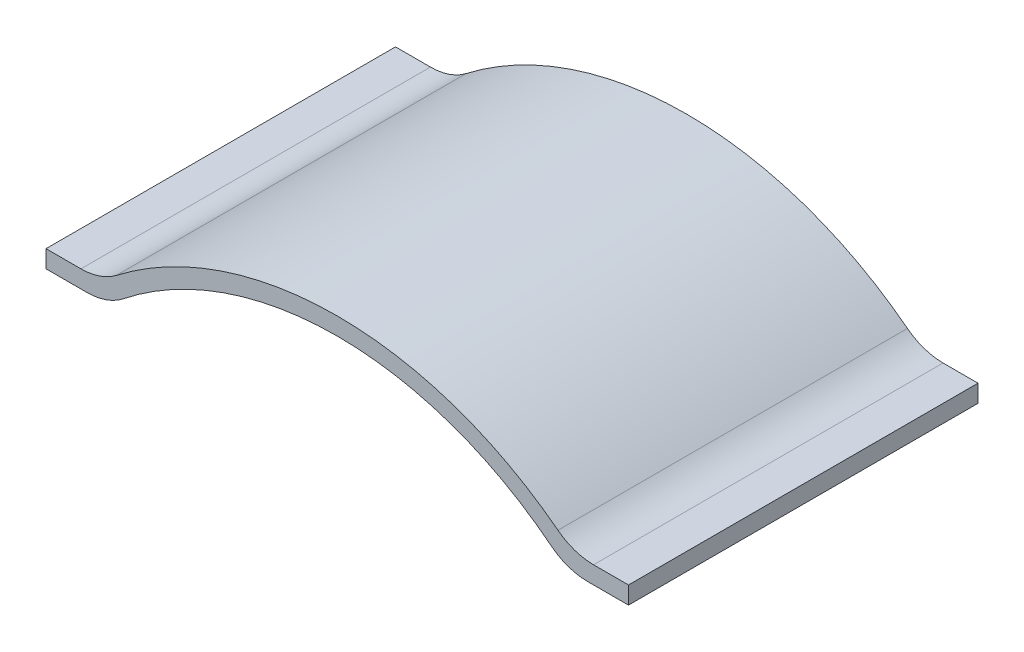
ISO-10303-21;
HEADER;
FILE_DESCRIPTION(('STEP AP214'),'2;1');
FILE_NAME('part.step','',(''),(''),'','','');
FILE_SCHEMA(('AUTOMOTIVE_DESIGN { 1 0 10303 214 1 1 1 1 }'));
ENDSEC;
DATA;
#1=APPLICATION_CONTEXT('core data for automotive mechanical design processes');
#2=APPLICATION_PROTOCOL_DEFINITION('international standard','automotive_design',2000,#1);
#3=PRODUCT_CONTEXT('',#1,'mechanical');
#4=PRODUCT('Part','Part','',(#3));
#5=PRODUCT_RELATED_PRODUCT_CATEGORY('part','',(#4));
#6=PRODUCT_DEFINITION_FORMATION('','',#4);
#7=PRODUCT_DEFINITION_CONTEXT('part definition',#1,'design');
#8=PRODUCT_DEFINITION('design','',#6,#7);
#9=PRODUCT_DEFINITION_SHAPE('','',#8);
#10=(LENGTH_UNIT() NAMED_UNIT(*) SI_UNIT(.MILLI.,.METRE.));
#11=(NAMED_UNIT(*) PLANE_ANGLE_UNIT() SI_UNIT($,.RADIAN.));
#12=(NAMED_UNIT(*) SI_UNIT($,.STERADIAN.) SOLID_ANGLE_UNIT());
#13=UNCERTAINTY_MEASURE_WITH_UNIT(LENGTH_MEASURE(1.E-05),#10,'distance_accuracy_value','');
#14=(GEOMETRIC_REPRESENTATION_CONTEXT(3) GLOBAL_UNCERTAINTY_ASSIGNED_CONTEXT((#13)) GLOBAL_UNIT_ASSIGNED_CONTEXT((#10,
#11,#12)) REPRESENTATION_CONTEXT('',''));
#15=CARTESIAN_POINT('',(0.,0.,0.));
#16=DIRECTION('',(0.,0.,1.));
#17=DIRECTION('',(1.,0.,0.));
#18=AXIS2_PLACEMENT_3D('',#15,#16,#17);
#19=CARTESIAN_POINT('',(0.,0.,60.));
#20=DIRECTION('',(0.,-1.,0.));
#21=DIRECTION('',(0.,0.,-1.));
#22=AXIS2_PLACEMENT_3D('',#19,#20,#21);
#23=PLANE('',#22);
#24=DIRECTION('',(-1.,0.,0.));
#25=VECTOR('',#24,1.);
#26=CARTESIAN_POINT('',(0.,0.,0.));
#27=LINE('',#26,#25);
#28=CARTESIAN_POINT('',(6.,0.,0.));
#29=VERTEX_POINT('',#28);
#30=CARTESIAN_POINT('',(0.,0.,0.));
#31=VERTEX_POINT('',#30);
#32=EDGE_CURVE('E159',#29,#31,#27,.T.);
#33=ORIENTED_EDGE('',*,*,#32,.T.);
#34=DIRECTION('',(0.,0.,-1.));
#35=VECTOR('',#34,1.);
#36=CARTESIAN_POINT('',(0.,0.,60.));
#37=LINE('',#36,#35);
#38=CARTESIAN_POINT('',(0.,0.,60.));
#39=VERTEX_POINT('',#38);
#40=EDGE_CURVE('E11',#39,#31,#37,.T.);
#41=ORIENTED_EDGE('',*,*,#40,.F.);
#42=DIRECTION('',(-1.,0.,0.));
#43=VECTOR('',#42,1.);
#44=CARTESIAN_POINT('',(0.,0.,60.));
#45=LINE('',#44,#43);
#46=CARTESIAN_POINT('',(6.,0.,60.));
#47=VERTEX_POINT('',#46);
#48=EDGE_CURVE('E181',#47,#39,#45,.T.);
#49=ORIENTED_EDGE('',*,*,#48,.F.);
#50=DIRECTION('',(0.,0.,-1.));
#51=VECTOR('',#50,1.);
#52=CARTESIAN_POINT('',(6.,0.,60.));
#53=LINE('',#52,#51);
#54=EDGE_CURVE('E155',#47,#29,#53,.T.);
#55=ORIENTED_EDGE('',*,*,#54,.T.);
#56=EDGE_LOOP('',(#33,#41,#49,#55));
#57=FACE_BOUND('',#56,.T.);
#58=ADVANCED_FACE('F39',(#57),#23,.F.);
#59=CARTESIAN_POINT('',(0.,0.,60.));
#60=DIRECTION('',(1.,0.,0.));
#61=DIRECTION('',(0.,0.,-1.));
#62=AXIS2_PLACEMENT_3D('',#59,#60,#61);
#63=PLANE('',#62);
#64=DIRECTION('',(0.,-1.,0.));
#65=VECTOR('',#64,1.);
#66=CARTESIAN_POINT('',(0.,0.,0.));
#67=LINE('',#66,#65);
#68=CARTESIAN_POINT('',(0.,-3.,0.));
#69=VERTEX_POINT('',#68);
#70=EDGE_CURVE('E162',#31,#69,#67,.T.);
#71=ORIENTED_EDGE('',*,*,#70,.T.);
#72=DIRECTION('',(0.,0.,-1.));
#73=VECTOR('',#72,1.);
#74=CARTESIAN_POINT('',(0.,-3.,60.));
#75=LINE('',#74,#73);
#76=CARTESIAN_POINT('',(0.,-3.,60.));
#77=VERTEX_POINT('',#76);
#78=EDGE_CURVE('E47',#77,#69,#75,.T.);
#79=ORIENTED_EDGE('',*,*,#78,.F.);
#80=DIRECTION('',(0.,-1.,0.));
#81=VECTOR('',#80,1.);
#82=CARTESIAN_POINT('',(0.,0.,60.));
#83=LINE('',#82,#81);
#84=EDGE_CURVE('E110',#39,#77,#83,.T.);
#85=ORIENTED_EDGE('',*,*,#84,.F.);
#86=ORIENTED_EDGE('',*,*,#40,.T.);
#87=EDGE_LOOP('',(#71,#79,#85,#86));
#88=FACE_BOUND('',#87,.T.);
#89=ADVANCED_FACE('F259',(#88),#63,.F.);
#90=CARTESIAN_POINT('',(0.,-3.,60.));
#91=DIRECTION('',(0.,1.,0.));
#92=DIRECTION('',(-1.,0.,0.));
#93=AXIS2_PLACEMENT_3D('',#90,#91,#92);
#94=PLANE('',#93);
#95=DIRECTION('',(1.,0.,0.));
#96=VECTOR('',#95,1.);
#97=CARTESIAN_POINT('',(0.,-3.,0.));
#98=LINE('',#97,#96);
#99=CARTESIAN_POINT('',(7.03489788211833,-3.,0.));
#100=VERTEX_POINT('',#99);
#101=EDGE_CURVE('E164',#69,#100,#98,.T.);
#102=ORIENTED_EDGE('',*,*,#101,.T.);
#103=DIRECTION('',(0.,0.,-1.));
#104=VECTOR('',#103,1.);
#105=CARTESIAN_POINT('',(7.03489788211833,-3.,60.));
#106=LINE('',#105,#104);
#107=CARTESIAN_POINT('',(7.03489788211833,-3.,60.));
#108=VERTEX_POINT('',#107);
#109=EDGE_CURVE('E200',#108,#100,#106,.T.);
#110=ORIENTED_EDGE('',*,*,#109,.F.);
#111=DIRECTION('',(1.,0.,0.));
#112=VECTOR('',#111,1.);
#113=CARTESIAN_POINT('',(0.,-3.,60.));
#114=LINE('',#113,#112);
#115=EDGE_CURVE('E208',#77,#108,#114,.T.);
#116=ORIENTED_EDGE('',*,*,#115,.F.);
#117=ORIENTED_EDGE('',*,*,#78,.T.);
#118=EDGE_LOOP('',(#102,#110,#116,#117));
#119=FACE_BOUND('',#118,.T.);
#120=ADVANCED_FACE('F206',(#119),#94,.F.);
#121=CARTESIAN_POINT('',(7.03489788211833,7.00000000000001,60.));
#122=DIRECTION('',(0.,0.,-1.));
#123=DIRECTION('',(-1.,0.,0.));
#124=AXIS2_PLACEMENT_3D('',#121,#122,#123);
#125=CYLINDRICAL_SURFACE('',#124,10.);
#126=CARTESIAN_POINT('',(7.03489788211833,7.00000000000001,0.));
#127=DIRECTION('',(0.,0.,1.));
#128=DIRECTION('',(1.,0.,0.));
#129=AXIS2_PLACEMENT_3D('',#126,#127,#128);
#130=CIRCLE('',#129,10.);
#131=CARTESIAN_POINT('',(13.2587175998221,-0.82713664896185,0.));
#132=VERTEX_POINT('',#131);
#133=EDGE_CURVE('E166',#100,#132,#130,.T.);
#134=ORIENTED_EDGE('',*,*,#133,.T.);
#135=DIRECTION('',(0.,0.,-1.));
#136=VECTOR('',#135,1.);
#137=CARTESIAN_POINT('',(13.2587175998221,-0.82713664896185,60.));
#138=LINE('',#137,#136);
#139=CARTESIAN_POINT('',(13.2587175998221,-0.82713664896185,60.));
#140=VERTEX_POINT('',#139);
#141=EDGE_CURVE('E197',#140,#132,#138,.T.);
#142=ORIENTED_EDGE('',*,*,#141,.F.);
#143=CARTESIAN_POINT('',(7.03489788211833,7.00000000000001,60.));
#144=DIRECTION('',(0.,0.,1.));
#145=DIRECTION('',(1.,0.,0.));
#146=AXIS2_PLACEMENT_3D('',#143,#144,#145);
#147=CIRCLE('',#146,10.);
#148=EDGE_CURVE('E226',#108,#140,#147,.T.);
#149=ORIENTED_EDGE('',*,*,#148,.F.);
#150=ORIENTED_EDGE('',*,*,#109,.T.);
#151=EDGE_LOOP('',(#134,#142,#149,#150));
#152=FACE_BOUND('',#151,.T.);
#153=ADVANCED_FACE('F217',(#152),#125,.T.);
#154=CARTESIAN_POINT('',(50.,-47.0333333333333,60.));
#155=DIRECTION('',(0.,0.,-1.));
#156=DIRECTION('',(-1.,0.,0.));
#157=AXIS2_PLACEMENT_3D('',#154,#155,#156);
#158=CYLINDRICAL_SURFACE('',#157,59.0333333333333);
#159=CARTESIAN_POINT('',(50.,-47.0333333333333,0.));
#160=DIRECTION('',(0.,0.,-1.));
#161=DIRECTION('',(1.,0.,0.));
#162=AXIS2_PLACEMENT_3D('',#159,#160,#161);
#163=CIRCLE('',#162,59.0333333333333);
#164=CARTESIAN_POINT('',(86.7412824001779,-0.827136648961849,0.));
#165=VERTEX_POINT('',#164);
#166=EDGE_CURVE('E168',#132,#165,#163,.T.);
#167=ORIENTED_EDGE('',*,*,#166,.T.);
#168=DIRECTION('',(0.,0.,-1.));
#169=VECTOR('',#168,1.);
#170=CARTESIAN_POINT('',(86.7412824001779,-0.827136648961849,60.));
#171=LINE('',#170,#169);
#172=CARTESIAN_POINT('',(86.7412824001779,-0.827136648961849,60.));
#173=VERTEX_POINT('',#172);
#174=EDGE_CURVE('E194',#173,#165,#171,.T.);
#175=ORIENTED_EDGE('',*,*,#174,.F.);
#176=CARTESIAN_POINT('',(50.,-47.0333333333333,60.));
#177=DIRECTION('',(0.,0.,-1.));
#178=DIRECTION('',(1.,0.,0.));
#179=AXIS2_PLACEMENT_3D('',#176,#177,#178);
#180=CIRCLE('',#179,59.0333333333333);
#181=EDGE_CURVE('E223',#140,#173,#180,.T.);
#182=ORIENTED_EDGE('',*,*,#181,.F.);
#183=ORIENTED_EDGE('',*,*,#141,.T.);
#184=EDGE_LOOP('',(#167,#175,#182,#183));
#185=FACE_BOUND('',#184,.T.);
#186=ADVANCED_FACE('F221',(#185),#158,.F.);
#187=CARTESIAN_POINT('',(92.9651021178817,7.00000000000001,60.));
#188=DIRECTION('',(0.,0.,-1.));
#189=DIRECTION('',(-1.,0.,0.));
#190=AXIS2_PLACEMENT_3D('',#187,#188,#189);
#191=CYLINDRICAL_SURFACE('',#190,10.);
#192=CARTESIAN_POINT('',(92.9651021178817,7.00000000000001,0.));
#193=DIRECTION('',(0.,0.,1.));
#194=DIRECTION('',(-1.,0.,0.));
#195=AXIS2_PLACEMENT_3D('',#192,#193,#194);
#196=CIRCLE('',#195,10.);
#197=CARTESIAN_POINT('',(92.9651021178817,-2.99999999999999,0.));
#198=VERTEX_POINT('',#197);
#199=EDGE_CURVE('E170',#165,#198,#196,.T.);
#200=ORIENTED_EDGE('',*,*,#199,.T.);
#201=DIRECTION('',(0.,0.,-1.));
#202=VECTOR('',#201,1.);
#203=CARTESIAN_POINT('',(92.9651021178817,-2.99999999999999,60.));
#204=LINE('',#203,#202);
#205=CARTESIAN_POINT('',(92.9651021178817,-2.99999999999999,60.));
#206=VERTEX_POINT('',#205);
#207=EDGE_CURVE('E191',#206,#198,#204,.T.);
#208=ORIENTED_EDGE('',*,*,#207,.F.);
#209=CARTESIAN_POINT('',(92.9651021178817,7.00000000000001,60.));
#210=DIRECTION('',(0.,0.,1.));
#211=DIRECTION('',(-1.,0.,0.));
#212=AXIS2_PLACEMENT_3D('',#209,#210,#211);
#213=CIRCLE('',#212,10.);
#214=EDGE_CURVE('E225',#173,#206,#213,.T.);
#215=ORIENTED_EDGE('',*,*,#214,.F.);
#216=ORIENTED_EDGE('',*,*,#174,.T.);
#217=EDGE_LOOP('',(#200,#208,#215,#216));
#218=FACE_BOUND('',#217,.T.);
#219=ADVANCED_FACE('F272',(#218),#191,.T.);
#220=CARTESIAN_POINT('',(100.,-3.,60.));
#221=DIRECTION('',(0.,1.,0.));
#222=DIRECTION('',(-1.,0.,0.));
#223=AXIS2_PLACEMENT_3D('',#220,#221,#222);
#224=PLANE('',#223);
#225=DIRECTION('',(1.,0.,0.));
#226=VECTOR('',#225,1.);
#227=CARTESIAN_POINT('',(100.,-3.,0.));
#228=LINE('',#227,#226);
#229=CARTESIAN_POINT('',(100.,-3.,0.));
#230=VERTEX_POINT('',#229);
#231=EDGE_CURVE('E172',#198,#230,#228,.T.);
#232=ORIENTED_EDGE('',*,*,#231,.T.);
#233=DIRECTION('',(0.,0.,-1.));
#234=VECTOR('',#233,1.);
#235=CARTESIAN_POINT('',(100.,-3.,60.));
#236=LINE('',#235,#234);
#237=CARTESIAN_POINT('',(100.,-3.,60.));
#238=VERTEX_POINT('',#237);
#239=EDGE_CURVE('E188',#238,#230,#236,.T.);
#240=ORIENTED_EDGE('',*,*,#239,.F.);
#241=DIRECTION('',(1.,0.,0.));
#242=VECTOR('',#241,1.);
#243=CARTESIAN_POINT('',(100.,-3.,60.));
#244=LINE('',#243,#242);
#245=EDGE_CURVE('E228',#206,#238,#244,.T.);
#246=ORIENTED_EDGE('',*,*,#245,.F.);
#247=ORIENTED_EDGE('',*,*,#207,.T.);
#248=EDGE_LOOP('',(#232,#240,#246,#247));
#249=FACE_BOUND('',#248,.T.);
#250=ADVANCED_FACE('F275',(#249),#224,.F.);
#251=CARTESIAN_POINT('',(100.,0.,60.));
#252=DIRECTION('',(-1.,0.,0.));
#253=DIRECTION('',(0.,0.,1.));
#254=AXIS2_PLACEMENT_3D('',#251,#252,#253);
#255=PLANE('',#254);
#256=DIRECTION('',(0.,1.,0.));
#257=VECTOR('',#256,1.);
#258=CARTESIAN_POINT('',(100.,0.,0.));
#259=LINE('',#258,#257);
#260=CARTESIAN_POINT('',(100.,0.,0.));
#261=VERTEX_POINT('',#260);
#262=EDGE_CURVE('E174',#230,#261,#259,.T.);
#263=ORIENTED_EDGE('',*,*,#262,.T.);
#264=DIRECTION('',(0.,0.,-1.));
#265=VECTOR('',#264,1.);
#266=CARTESIAN_POINT('',(100.,0.,60.));
#267=LINE('',#266,#265);
#268=CARTESIAN_POINT('',(100.,0.,60.));
#269=VERTEX_POINT('',#268);
#270=EDGE_CURVE('E185',#269,#261,#267,.T.);
#271=ORIENTED_EDGE('',*,*,#270,.F.);
#272=DIRECTION('',(0.,1.,0.));
#273=VECTOR('',#272,1.);
#274=CARTESIAN_POINT('',(100.,0.,60.));
#275=LINE('',#274,#273);
#276=EDGE_CURVE('E234',#238,#269,#275,.T.);
#277=ORIENTED_EDGE('',*,*,#276,.F.);
#278=ORIENTED_EDGE('',*,*,#239,.T.);
#279=EDGE_LOOP('',(#263,#271,#277,#278));
#280=FACE_BOUND('',#279,.T.);
#281=ADVANCED_FACE('F240',(#280),#255,.F.);
#282=CARTESIAN_POINT('',(100.,0.,60.));
#283=DIRECTION('',(0.,-1.,0.));
#284=DIRECTION('',(0.,0.,-1.));
#285=AXIS2_PLACEMENT_3D('',#282,#283,#284);
#286=PLANE('',#285);
#287=DIRECTION('',(-1.,0.,0.));
#288=VECTOR('',#287,1.);
#289=CARTESIAN_POINT('',(100.,0.,0.));
#290=LINE('',#289,#288);
#291=CARTESIAN_POINT('',(94.,0.,0.));
#292=VERTEX_POINT('',#291);
#293=EDGE_CURVE('E176',#261,#292,#290,.T.);
#294=ORIENTED_EDGE('',*,*,#293,.T.);
#295=DIRECTION('',(0.,0.,-1.));
#296=VECTOR('',#295,1.);
#297=CARTESIAN_POINT('',(94.,0.,60.));
#298=LINE('',#297,#296);
#299=CARTESIAN_POINT('',(94.,0.,60.));
#300=VERTEX_POINT('',#299);
#301=EDGE_CURVE('E150',#300,#292,#298,.T.);
#302=ORIENTED_EDGE('',*,*,#301,.F.);
#303=DIRECTION('',(-1.,0.,0.));
#304=VECTOR('',#303,1.);
#305=CARTESIAN_POINT('',(100.,0.,60.));
#306=LINE('',#305,#304);
#307=EDGE_CURVE('E141',#269,#300,#306,.T.);
#308=ORIENTED_EDGE('',*,*,#307,.F.);
#309=ORIENTED_EDGE('',*,*,#270,.T.);
#310=EDGE_LOOP('',(#294,#302,#308,#309));
#311=FACE_BOUND('',#310,.T.);
#312=ADVANCED_FACE('F244',(#311),#286,.F.);
#313=CARTESIAN_POINT('',(94.,10.,60.));
#314=DIRECTION('',(0.,0.,-1.));
#315=DIRECTION('',(-1.,0.,0.));
#316=AXIS2_PLACEMENT_3D('',#313,#314,#315);
#317=CYLINDRICAL_SURFACE('',#316,9.99999999999999);
#318=CARTESIAN_POINT('',(94.,10.,0.));
#319=DIRECTION('',(0.,0.,-1.));
#320=DIRECTION('',(-1.,0.,0.));
#321=AXIS2_PLACEMENT_3D('',#318,#319,#320);
#322=CIRCLE('',#321,9.99999999999999);
#323=CARTESIAN_POINT('',(87.8917167977788,2.0823692734845,0.));
#324=VERTEX_POINT('',#323);
#325=EDGE_CURVE('E149',#292,#324,#322,.T.);
#326=ORIENTED_EDGE('',*,*,#325,.T.);
#327=DIRECTION('',(0.,0.,-1.));
#328=VECTOR('',#327,1.);
#329=CARTESIAN_POINT('',(87.8917167977788,2.0823692734845,60.));
#330=LINE('',#329,#328);
#331=CARTESIAN_POINT('',(87.8917167977788,2.0823692734845,60.));
#332=VERTEX_POINT('',#331);
#333=EDGE_CURVE('E146',#332,#324,#330,.T.);
#334=ORIENTED_EDGE('',*,*,#333,.F.);
#335=CARTESIAN_POINT('',(94.,10.,60.));
#336=DIRECTION('',(0.,0.,-1.));
#337=DIRECTION('',(-1.,0.,0.));
#338=AXIS2_PLACEMENT_3D('',#335,#336,#337);
#339=CIRCLE('',#338,9.99999999999999);
#340=EDGE_CURVE('E135',#300,#332,#339,.T.);
#341=ORIENTED_EDGE('',*,*,#340,.F.);
#342=ORIENTED_EDGE('',*,*,#301,.T.);
#343=EDGE_LOOP('',(#326,#334,#341,#342));
#344=FACE_BOUND('',#343,.T.);
#345=ADVANCED_FACE('F147',(#344),#317,.F.);
#346=CARTESIAN_POINT('',(50.,-47.0333333333333,60.));
#347=DIRECTION('',(0.,0.,-1.));
#348=DIRECTION('',(-1.,0.,0.));
#349=AXIS2_PLACEMENT_3D('',#346,#347,#348);
#350=CYLINDRICAL_SURFACE('',#349,62.0333333333333);
#351=CARTESIAN_POINT('',(50.,-47.0333333333333,0.));
#352=DIRECTION('',(0.,0.,1.));
#353=DIRECTION('',(1.,0.,0.));
#354=AXIS2_PLACEMENT_3D('',#351,#352,#353);
#355=CIRCLE('',#354,62.0333333333333);
#356=CARTESIAN_POINT('',(12.1082832022212,2.0823692734845,0.));
#357=VERTEX_POINT('',#356);
#358=EDGE_CURVE('E96',#324,#357,#355,.T.);
#359=ORIENTED_EDGE('',*,*,#358,.T.);
#360=DIRECTION('',(0.,0.,-1.));
#361=VECTOR('',#360,1.);
#362=CARTESIAN_POINT('',(12.1082832022212,2.0823692734845,60.));
#363=LINE('',#362,#361);
#364=CARTESIAN_POINT('',(12.1082832022212,2.0823692734845,60.));
#365=VERTEX_POINT('',#364);
#366=EDGE_CURVE('E151',#365,#357,#363,.T.);
#367=ORIENTED_EDGE('',*,*,#366,.F.);
#368=CARTESIAN_POINT('',(50.,-47.0333333333333,60.));
#369=DIRECTION('',(0.,0.,1.));
#370=DIRECTION('',(1.,0.,0.));
#371=AXIS2_PLACEMENT_3D('',#368,#369,#370);
#372=CIRCLE('',#371,62.0333333333333);
#373=EDGE_CURVE('E139',#332,#365,#372,.T.);
#374=ORIENTED_EDGE('',*,*,#373,.F.);
#375=ORIENTED_EDGE('',*,*,#333,.T.);
#376=EDGE_LOOP('',(#359,#367,#374,#375));
#377=FACE_BOUND('',#376,.T.);
#378=ADVANCED_FACE('F153',(#377),#350,.T.);
#379=CARTESIAN_POINT('',(6.,10.,60.));
#380=DIRECTION('',(0.,0.,-1.));
#381=DIRECTION('',(-1.,0.,0.));
#382=AXIS2_PLACEMENT_3D('',#379,#380,#381);
#383=CYLINDRICAL_SURFACE('',#382,10.);
#384=CARTESIAN_POINT('',(6.,10.,0.));
#385=DIRECTION('',(0.,0.,-1.));
#386=DIRECTION('',(1.,0.,0.));
#387=AXIS2_PLACEMENT_3D('',#384,#385,#386);
#388=CIRCLE('',#387,10.);
#389=EDGE_CURVE('E102',#357,#29,#388,.T.);
#390=ORIENTED_EDGE('',*,*,#389,.T.);
#391=ORIENTED_EDGE('',*,*,#54,.F.);
#392=CARTESIAN_POINT('',(6.,10.,60.));
#393=DIRECTION('',(0.,0.,-1.));
#394=DIRECTION('',(1.,0.,0.));
#395=AXIS2_PLACEMENT_3D('',#392,#393,#394);
#396=CIRCLE('',#395,10.);
#397=EDGE_CURVE('E55',#365,#47,#396,.T.);
#398=ORIENTED_EDGE('',*,*,#397,.F.);
#399=ORIENTED_EDGE('',*,*,#366,.T.);
#400=EDGE_LOOP('',(#390,#391,#398,#399));
#401=FACE_BOUND('',#400,.T.);
#402=ADVANCED_FACE('F248',(#401),#383,.F.);
#403=CARTESIAN_POINT('',(6.,10.,60.));
#404=DIRECTION('',(0.,0.,1.));
#405=DIRECTION('',(1.,0.,0.));
#406=AXIS2_PLACEMENT_3D('',#403,#404,#405);
#407=PLANE('',#406);
#408=ORIENTED_EDGE('',*,*,#48,.T.);
#409=ORIENTED_EDGE('',*,*,#84,.T.);
#410=ORIENTED_EDGE('',*,*,#115,.T.);
#411=ORIENTED_EDGE('',*,*,#148,.T.);
#412=ORIENTED_EDGE('',*,*,#181,.T.);
#413=ORIENTED_EDGE('',*,*,#214,.T.);
#414=ORIENTED_EDGE('',*,*,#245,.T.);
#415=ORIENTED_EDGE('',*,*,#276,.T.);
#416=ORIENTED_EDGE('',*,*,#307,.T.);
#417=ORIENTED_EDGE('',*,*,#340,.T.);
#418=ORIENTED_EDGE('',*,*,#373,.T.);
#419=ORIENTED_EDGE('',*,*,#397,.T.);
#420=EDGE_LOOP('',(#408,#409,#410,#411,#412,#413,#414,#415,#416,#417,#418,#419));
#421=FACE_BOUND('',#420,.T.);
#422=ADVANCED_FACE('F137',(#421),#407,.T.);
#423=CARTESIAN_POINT('',(6.,10.,0.));
#424=DIRECTION('',(0.,0.,1.));
#425=DIRECTION('',(1.,0.,0.));
#426=AXIS2_PLACEMENT_3D('',#423,#424,#425);
#427=PLANE('',#426);
#428=ORIENTED_EDGE('',*,*,#32,.F.);
#429=ORIENTED_EDGE('',*,*,#389,.F.);
#430=ORIENTED_EDGE('',*,*,#358,.F.);
#431=ORIENTED_EDGE('',*,*,#325,.F.);
#432=ORIENTED_EDGE('',*,*,#293,.F.);
#433=ORIENTED_EDGE('',*,*,#262,.F.);
#434=ORIENTED_EDGE('',*,*,#231,.F.);
#435=ORIENTED_EDGE('',*,*,#199,.F.);
#436=ORIENTED_EDGE('',*,*,#166,.F.);
#437=ORIENTED_EDGE('',*,*,#133,.F.);
#438=ORIENTED_EDGE('',*,*,#101,.F.);
#439=ORIENTED_EDGE('',*,*,#70,.F.);
#440=EDGE_LOOP('',(#428,#429,#430,#431,#432,#433,#434,#435,#436,#437,#438,#439));
#441=FACE_BOUND('',#440,.T.);
#442=ADVANCED_FACE('F212',(#441),#427,.F.);
#443=CLOSED_SHELL('',(#58,#89,#120,#153,#186,#219,#250,#281,#312,#345,#378,#402,#422,#442));
#444=MANIFOLD_SOLID_BREP('B2',#443);
#445=ADVANCED_BREP_SHAPE_REPRESENTATION('',(#18,#444),#14);
#446=SHAPE_DEFINITION_REPRESENTATION(#9,#445);
ENDSEC;
END-ISO-10303-21;
